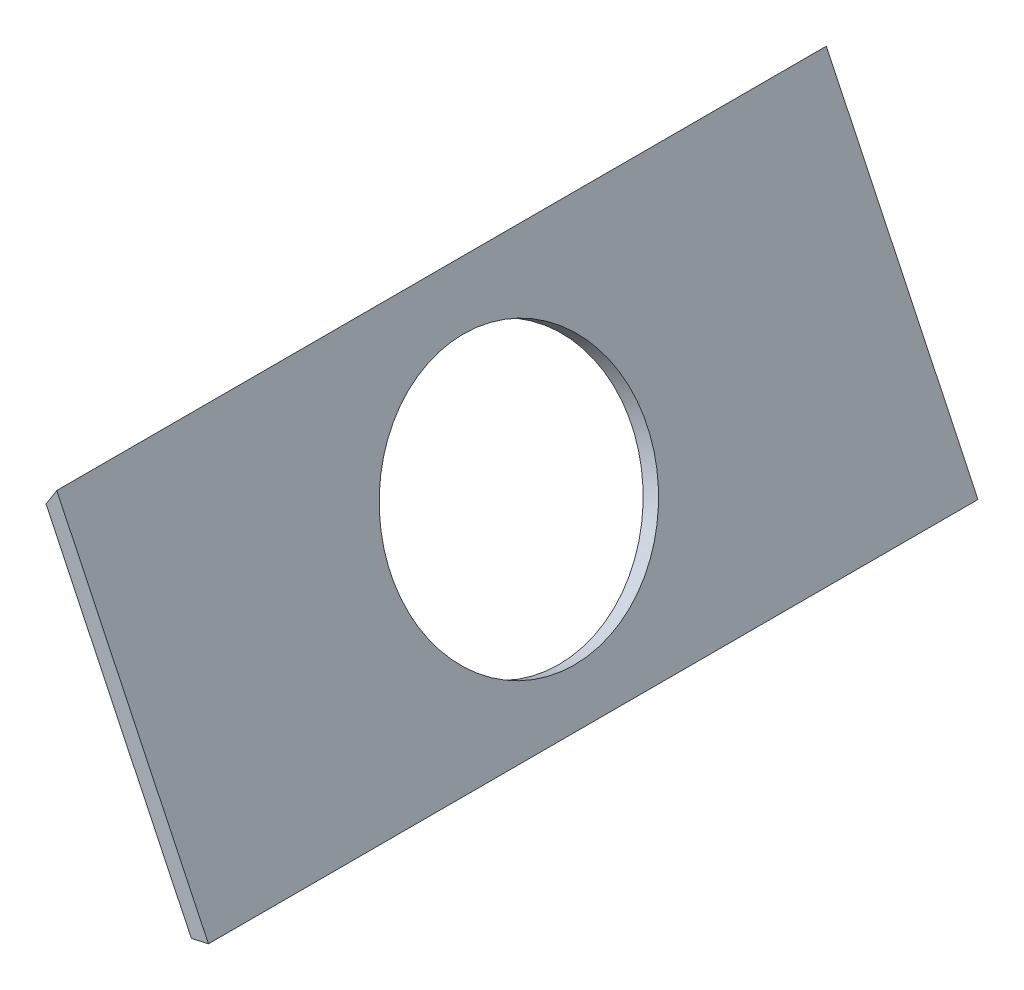
ISO-10303-21;
HEADER;
FILE_DESCRIPTION(('STEP AP214'),'2;1');
FILE_NAME('part.step','',(''),(''),'','','');
FILE_SCHEMA(('AUTOMOTIVE_DESIGN { 1 0 10303 214 1 1 1 1 }'));
ENDSEC;
DATA;
#1=APPLICATION_CONTEXT('core data for automotive mechanical design processes');
#2=APPLICATION_PROTOCOL_DEFINITION('international standard','automotive_design',2000,#1);
#3=PRODUCT_CONTEXT('',#1,'mechanical');
#4=PRODUCT('Part','Part','',(#3));
#5=PRODUCT_RELATED_PRODUCT_CATEGORY('part','',(#4));
#6=PRODUCT_DEFINITION_FORMATION('','',#4);
#7=PRODUCT_DEFINITION_CONTEXT('part definition',#1,'design');
#8=PRODUCT_DEFINITION('design','',#6,#7);
#9=PRODUCT_DEFINITION_SHAPE('','',#8);
#10=(LENGTH_UNIT() NAMED_UNIT(*) SI_UNIT(.MILLI.,.METRE.));
#11=(NAMED_UNIT(*) PLANE_ANGLE_UNIT() SI_UNIT($,.RADIAN.));
#12=(NAMED_UNIT(*) SI_UNIT($,.STERADIAN.) SOLID_ANGLE_UNIT());
#13=UNCERTAINTY_MEASURE_WITH_UNIT(LENGTH_MEASURE(1.E-05),#10,'distance_accuracy_value','');
#14=(GEOMETRIC_REPRESENTATION_CONTEXT(3) GLOBAL_UNCERTAINTY_ASSIGNED_CONTEXT((#13)) GLOBAL_UNIT_ASSIGNED_CONTEXT((#10,
#11,#12)) REPRESENTATION_CONTEXT('',''));
#15=CARTESIAN_POINT('',(0.,0.,0.));
#16=DIRECTION('',(0.,0.,1.));
#17=DIRECTION('',(1.,0.,0.));
#18=AXIS2_PLACEMENT_3D('',#15,#16,#17);
#19=CARTESIAN_POINT('',(331.858259493534,76.5236735602839,450.));
#20=DIRECTION('',(0.901919134345837,0.431904937574063,0.));
#21=DIRECTION('',(-0.431904937574063,0.901919134345838,0.));
#22=AXIS2_PLACEMENT_3D('',#19,#20,#21);
#23=PLANE('',#22);
#24=CARTESIAN_POINT('',(289.358813636246,165.272516379915,225.));
#25=DIRECTION('',(-0.901919134345837,-0.431904937574063,0.));
#26=DIRECTION('',(0.431904937574063,-0.901919134345837,0.));
#27=AXIS2_PLACEMENT_3D('',#24,#25,#26);
#28=CIRCLE('',#27,75.);
#29=CARTESIAN_POINT('',(321.7516839543,97.6285813039769,225.));
#30=VERTEX_POINT('',#29);
#31=EDGE_CURVE('E111',#30,#30,#28,.T.);
#32=ORIENTED_EDGE('',*,*,#31,.F.);
#33=EDGE_LOOP('',(#32));
#34=FACE_BOUND('',#33,.T.);
#35=DIRECTION('',(0.431904937574063,-0.901919134345837,0.));
#36=VECTOR('',#35,1.);
#37=CARTESIAN_POINT('',(331.858259493534,76.5236735602839,0.));
#38=LINE('',#37,#36);
#39=CARTESIAN_POINT('',(246.858259493534,254.023673560284,0.));
#40=VERTEX_POINT('',#39);
#41=CARTESIAN_POINT('',(331.858259493534,76.5236735602839,0.));
#42=VERTEX_POINT('',#41);
#43=EDGE_CURVE('E98',#40,#42,#38,.T.);
#44=ORIENTED_EDGE('',*,*,#43,.T.);
#45=DIRECTION('',(0.,0.,-1.));
#46=VECTOR('',#45,1.);
#47=CARTESIAN_POINT('',(331.858259493534,76.5236735602839,450.));
#48=LINE('',#47,#46);
#49=CARTESIAN_POINT('',(331.858259493534,76.5236735602839,450.));
#50=VERTEX_POINT('',#49);
#51=EDGE_CURVE('E11',#50,#42,#48,.T.);
#52=ORIENTED_EDGE('',*,*,#51,.F.);
#53=DIRECTION('',(0.431904937574063,-0.901919134345837,0.));
#54=VECTOR('',#53,1.);
#55=CARTESIAN_POINT('',(331.858259493534,76.5236735602839,450.));
#56=LINE('',#55,#54);
#57=CARTESIAN_POINT('',(246.858259493534,254.023673560284,450.));
#58=VERTEX_POINT('',#57);
#59=EDGE_CURVE('E85',#58,#50,#56,.T.);
#60=ORIENTED_EDGE('',*,*,#59,.F.);
#61=DIRECTION('',(0.,0.,-1.));
#62=VECTOR('',#61,1.);
#63=CARTESIAN_POINT('',(246.858259493534,254.023673560284,450.));
#64=LINE('',#63,#62);
#65=EDGE_CURVE('E94',#58,#40,#64,.T.);
#66=ORIENTED_EDGE('',*,*,#65,.T.);
#67=EDGE_LOOP('',(#44,#52,#60,#66));
#68=FACE_BOUND('',#67,.T.);
#69=ADVANCED_FACE('F33',(#34,#68),#23,.F.);
#70=CARTESIAN_POINT('',(341.858259493534,78.7945636826585,450.));
#71=DIRECTION('',(-0.221450745826469,0.975171557815803,0.));
#72=DIRECTION('',(-0.975171557815803,-0.22145074582647,0.));
#73=AXIS2_PLACEMENT_3D('',#70,#71,#72);
#74=PLANE('',#73);
#75=DIRECTION('',(0.975171557815803,0.22145074582647,0.));
#76=VECTOR('',#75,1.);
#77=CARTESIAN_POINT('',(341.858259493534,78.7945636826585,0.));
#78=LINE('',#77,#76);
#79=CARTESIAN_POINT('',(341.858259493534,78.7945636826585,0.));
#80=VERTEX_POINT('',#79);
#81=EDGE_CURVE('E89',#42,#80,#78,.T.);
#82=ORIENTED_EDGE('',*,*,#81,.T.);
#83=DIRECTION('',(0.,0.,-1.));
#84=VECTOR('',#83,1.);
#85=CARTESIAN_POINT('',(341.858259493534,78.7945636826585,450.));
#86=LINE('',#85,#84);
#87=CARTESIAN_POINT('',(341.858259493534,78.7945636826585,450.));
#88=VERTEX_POINT('',#87);
#89=EDGE_CURVE('E42',#88,#80,#86,.T.);
#90=ORIENTED_EDGE('',*,*,#89,.F.);
#91=DIRECTION('',(0.975171557815803,0.22145074582647,0.));
#92=VECTOR('',#91,1.);
#93=CARTESIAN_POINT('',(341.858259493534,78.7945636826585,450.));
#94=LINE('',#93,#92);
#95=EDGE_CURVE('E80',#50,#88,#94,.T.);
#96=ORIENTED_EDGE('',*,*,#95,.F.);
#97=ORIENTED_EDGE('',*,*,#51,.T.);
#98=EDGE_LOOP('',(#82,#90,#96,#97));
#99=FACE_BOUND('',#98,.T.);
#100=ADVANCED_FACE('F88',(#99),#74,.F.);
#101=CARTESIAN_POINT('',(341.858259493534,78.7945636826585,450.));
#102=DIRECTION('',(-0.901919134345837,-0.431904937574063,0.));
#103=DIRECTION('',(0.431904937574063,-0.901919134345837,0.));
#104=AXIS2_PLACEMENT_3D('',#101,#102,#103);
#105=PLANE('',#104);
#106=CARTESIAN_POINT('',(298.378004979704,169.591565755655,225.));
#107=DIRECTION('',(-0.901919134345837,-0.431904937574063,0.));
#108=DIRECTION('',(0.431904937574063,-0.901919134345837,0.));
#109=AXIS2_PLACEMENT_3D('',#106,#107,#108);
#110=CIRCLE('',#109,75.);
#111=CARTESIAN_POINT('',(330.770875297759,101.947630679718,225.));
#112=VERTEX_POINT('',#111);
#113=EDGE_CURVE('E36',#112,#112,#110,.T.);
#114=ORIENTED_EDGE('',*,*,#113,.T.);
#115=EDGE_LOOP('',(#114));
#116=FACE_BOUND('',#115,.T.);
#117=DIRECTION('',(-0.431904937574063,0.901919134345837,0.));
#118=VECTOR('',#117,1.);
#119=CARTESIAN_POINT('',(341.858259493534,78.7945636826585,0.));
#120=LINE('',#119,#118);
#121=CARTESIAN_POINT('',(253.156995608474,264.023673560284,0.));
#122=VERTEX_POINT('',#121);
#123=EDGE_CURVE('E67',#80,#122,#120,.T.);
#124=ORIENTED_EDGE('',*,*,#123,.T.);
#125=DIRECTION('',(0.,0.,-1.));
#126=VECTOR('',#125,1.);
#127=CARTESIAN_POINT('',(253.156995608474,264.023673560284,450.));
#128=LINE('',#127,#126);
#129=CARTESIAN_POINT('',(253.156995608474,264.023673560284,450.));
#130=VERTEX_POINT('',#129);
#131=EDGE_CURVE('E90',#130,#122,#128,.T.);
#132=ORIENTED_EDGE('',*,*,#131,.F.);
#133=DIRECTION('',(-0.431904937574063,0.901919134345837,0.));
#134=VECTOR('',#133,1.);
#135=CARTESIAN_POINT('',(341.858259493534,78.7945636826585,450.));
#136=LINE('',#135,#134);
#137=EDGE_CURVE('E83',#88,#130,#136,.T.);
#138=ORIENTED_EDGE('',*,*,#137,.F.);
#139=ORIENTED_EDGE('',*,*,#89,.T.);
#140=EDGE_LOOP('',(#124,#132,#138,#139));
#141=FACE_BOUND('',#140,.T.);
#142=ADVANCED_FACE('F92',(#116,#141),#105,.F.);
#143=CARTESIAN_POINT('',(253.156995608474,264.023673560284,450.));
#144=DIRECTION('',(0.8461397454245,-0.532961097279119,0.));
#145=DIRECTION('',(0.532961097279119,0.8461397454245,0.));
#146=AXIS2_PLACEMENT_3D('',#143,#144,#145);
#147=PLANE('',#146);
#148=DIRECTION('',(-0.532961097279119,-0.8461397454245,0.));
#149=VECTOR('',#148,1.);
#150=CARTESIAN_POINT('',(253.156995608474,264.023673560284,0.));
#151=LINE('',#150,#149);
#152=EDGE_CURVE('E73',#122,#40,#151,.T.);
#153=ORIENTED_EDGE('',*,*,#152,.T.);
#154=ORIENTED_EDGE('',*,*,#65,.F.);
#155=DIRECTION('',(-0.532961097279119,-0.8461397454245,0.));
#156=VECTOR('',#155,1.);
#157=CARTESIAN_POINT('',(253.156995608474,264.023673560284,450.));
#158=LINE('',#157,#156);
#159=EDGE_CURVE('E50',#130,#58,#158,.T.);
#160=ORIENTED_EDGE('',*,*,#159,.F.);
#161=ORIENTED_EDGE('',*,*,#131,.T.);
#162=EDGE_LOOP('',(#153,#154,#160,#161));
#163=FACE_BOUND('',#162,.T.);
#164=ADVANCED_FACE('F105',(#163),#147,.F.);
#165=CARTESIAN_POINT('',(0.,0.,450.));
#166=DIRECTION('',(0.,0.,1.));
#167=DIRECTION('',(1.,0.,0.));
#168=AXIS2_PLACEMENT_3D('',#165,#166,#167);
#169=PLANE('',#168);
#170=ORIENTED_EDGE('',*,*,#59,.T.);
#171=ORIENTED_EDGE('',*,*,#95,.T.);
#172=ORIENTED_EDGE('',*,*,#137,.T.);
#173=ORIENTED_EDGE('',*,*,#159,.T.);
#174=EDGE_LOOP('',(#170,#171,#172,#173));
#175=FACE_BOUND('',#174,.T.);
#176=ADVANCED_FACE('F81',(#175),#169,.T.);
#177=CARTESIAN_POINT('',(0.,0.,0.));
#178=DIRECTION('',(0.,0.,1.));
#179=DIRECTION('',(1.,0.,0.));
#180=AXIS2_PLACEMENT_3D('',#177,#178,#179);
#181=PLANE('',#180);
#182=ORIENTED_EDGE('',*,*,#43,.F.);
#183=ORIENTED_EDGE('',*,*,#152,.F.);
#184=ORIENTED_EDGE('',*,*,#123,.F.);
#185=ORIENTED_EDGE('',*,*,#81,.F.);
#186=EDGE_LOOP('',(#182,#183,#184,#185));
#187=FACE_BOUND('',#186,.T.);
#188=ADVANCED_FACE('F108',(#187),#181,.F.);
#189=CARTESIAN_POINT('',(289.358813636246,165.272516379915,225.));
#190=DIRECTION('',(-0.901919134345837,-0.431904937574063,0.));
#191=DIRECTION('',(0.431904937574063,-0.901919134345837,0.));
#192=AXIS2_PLACEMENT_3D('',#189,#190,#191);
#193=CYLINDRICAL_SURFACE('',#192,75.);
#194=ORIENTED_EDGE('',*,*,#31,.T.);
#195=EDGE_LOOP('',(#194));
#196=FACE_BOUND('',#195,.T.);
#197=ORIENTED_EDGE('',*,*,#113,.F.);
#198=EDGE_LOOP('',(#197));
#199=FACE_BOUND('',#198,.T.);
#200=ADVANCED_FACE('F119',(#196,#199),#193,.F.);
#201=CLOSED_SHELL('',(#69,#100,#142,#164,#176,#188,#200));
#202=MANIFOLD_SOLID_BREP('B2',#201);
#203=ADVANCED_BREP_SHAPE_REPRESENTATION('',(#18,#202),#14);
#204=SHAPE_DEFINITION_REPRESENTATION(#9,#203);
ENDSEC;
END-ISO-10303-21;
